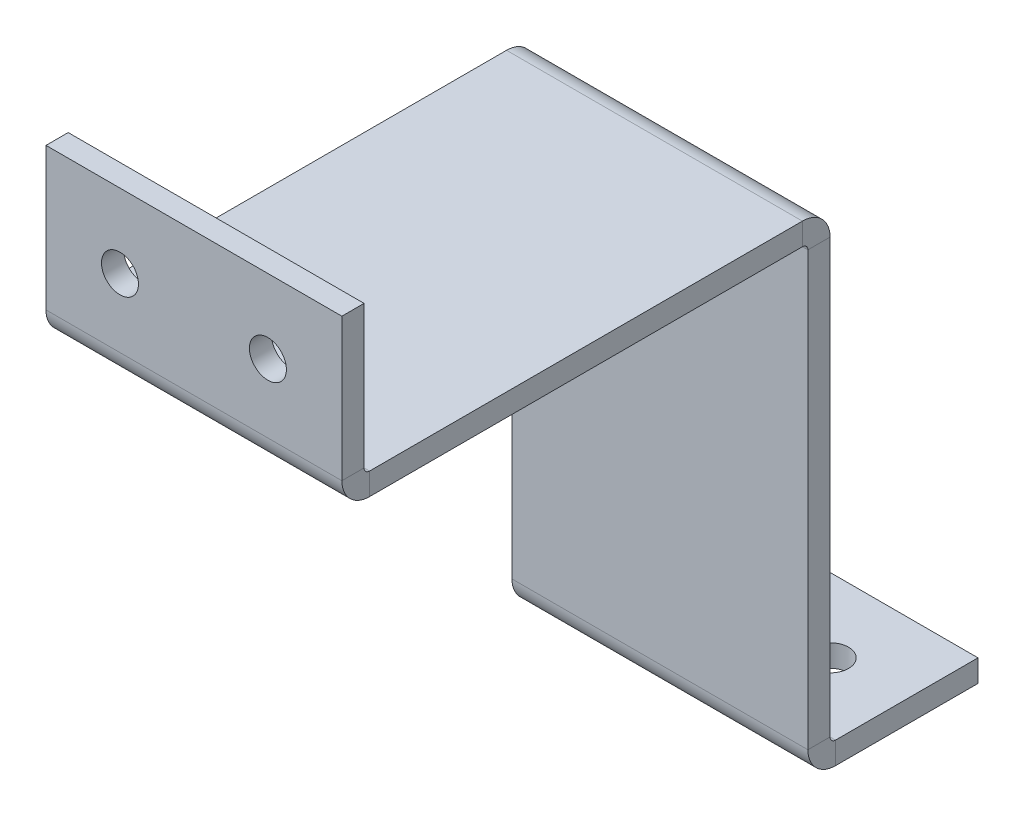
ISO-10303-21;
HEADER;
FILE_DESCRIPTION(('STEP AP214'),'2;1');
FILE_NAME('part.step','',(''),(''),'','','');
FILE_SCHEMA(('AUTOMOTIVE_DESIGN { 1 0 10303 214 1 1 1 1 }'));
ENDSEC;
DATA;
#1=APPLICATION_CONTEXT('core data for automotive mechanical design processes');
#2=APPLICATION_PROTOCOL_DEFINITION('international standard','automotive_design',2000,#1);
#3=PRODUCT_CONTEXT('',#1,'mechanical');
#4=PRODUCT('Part','Part','',(#3));
#5=PRODUCT_RELATED_PRODUCT_CATEGORY('part','',(#4));
#6=PRODUCT_DEFINITION_FORMATION('','',#4);
#7=PRODUCT_DEFINITION_CONTEXT('part definition',#1,'design');
#8=PRODUCT_DEFINITION('design','',#6,#7);
#9=PRODUCT_DEFINITION_SHAPE('','',#8);
#10=(LENGTH_UNIT() NAMED_UNIT(*) SI_UNIT(.MILLI.,.METRE.));
#11=(NAMED_UNIT(*) PLANE_ANGLE_UNIT() SI_UNIT($,.RADIAN.));
#12=(NAMED_UNIT(*) SI_UNIT($,.STERADIAN.) SOLID_ANGLE_UNIT());
#13=UNCERTAINTY_MEASURE_WITH_UNIT(LENGTH_MEASURE(1.E-05),#10,'distance_accuracy_value','');
#14=(GEOMETRIC_REPRESENTATION_CONTEXT(3) GLOBAL_UNCERTAINTY_ASSIGNED_CONTEXT((#13)) GLOBAL_UNIT_ASSIGNED_CONTEXT((#10,
#11,#12)) REPRESENTATION_CONTEXT('',''));
#15=CARTESIAN_POINT('',(0.,0.,0.));
#16=DIRECTION('',(0.,0.,1.));
#17=DIRECTION('',(1.,0.,0.));
#18=AXIS2_PLACEMENT_3D('',#15,#16,#17);
#19=CARTESIAN_POINT('',(20.,63.,73.0000000000002));
#20=DIRECTION('',(1.,0.,0.));
#21=DIRECTION('',(0.,0.,-1.));
#22=AXIS2_PLACEMENT_3D('',#19,#20,#21);
#23=PLANE('',#22);
#24=DIRECTION('',(0.,0.,1.));
#25=VECTOR('',#24,1.);
#26=CARTESIAN_POINT('',(20.,63.,73.0000000000002));
#27=LINE('',#26,#25);
#28=CARTESIAN_POINT('',(20.,63.,13.7366000000002));
#29=VERTEX_POINT('',#28);
#30=CARTESIAN_POINT('',(20.,63.,72.2634000000002));
#31=VERTEX_POINT('',#30);
#32=EDGE_CURVE('E213',#29,#31,#27,.T.);
#33=ORIENTED_EDGE('',*,*,#32,.T.);
#34=DIRECTION('',(0.,-1.,0.));
#35=VECTOR('',#34,1.);
#36=CARTESIAN_POINT('',(20.,63.,72.2634000000002));
#37=LINE('',#36,#35);
#38=CARTESIAN_POINT('',(20.,60.,72.2634000000002));
#39=VERTEX_POINT('',#38);
#40=EDGE_CURVE('E189',#31,#39,#37,.T.);
#41=ORIENTED_EDGE('',*,*,#40,.T.);
#42=DIRECTION('',(0.,0.,1.));
#43=VECTOR('',#42,1.);
#44=CARTESIAN_POINT('',(20.,60.,73.0000000000002));
#45=LINE('',#44,#43);
#46=CARTESIAN_POINT('',(20.,60.,13.7366000000002));
#47=VERTEX_POINT('',#46);
#48=EDGE_CURVE('E212',#47,#39,#45,.T.);
#49=ORIENTED_EDGE('',*,*,#48,.F.);
#50=DIRECTION('',(0.,1.,0.));
#51=VECTOR('',#50,1.);
#52=CARTESIAN_POINT('',(20.,60.,13.7366000000002));
#53=LINE('',#52,#51);
#54=EDGE_CURVE('E199',#47,#29,#53,.T.);
#55=ORIENTED_EDGE('',*,*,#54,.T.);
#56=EDGE_LOOP('',(#33,#41,#49,#55));
#57=FACE_BOUND('',#56,.T.);
#58=ADVANCED_FACE('F32',(#57),#23,.T.);
#59=CARTESIAN_POINT('',(-20.,63.,13.0000000000002));
#60=DIRECTION('',(0.,1.,0.));
#61=DIRECTION('',(0.,0.,1.));
#62=AXIS2_PLACEMENT_3D('',#59,#60,#61);
#63=PLANE('',#62);
#64=DIRECTION('',(0.,0.,-1.));
#65=VECTOR('',#64,1.);
#66=CARTESIAN_POINT('',(-20.,63.,13.0000000000002));
#67=LINE('',#66,#65);
#68=CARTESIAN_POINT('',(-20.,63.,72.2634000000002));
#69=VERTEX_POINT('',#68);
#70=CARTESIAN_POINT('',(-20.,63.,13.7366000000002));
#71=VERTEX_POINT('',#70);
#72=EDGE_CURVE('E215',#69,#71,#67,.T.);
#73=ORIENTED_EDGE('',*,*,#72,.F.);
#74=DIRECTION('',(1.,0.,0.));
#75=VECTOR('',#74,1.);
#76=CARTESIAN_POINT('',(20.,63.,72.2634000000002));
#77=LINE('',#76,#75);
#78=EDGE_CURVE('E54',#31,#69,#77,.F.);
#79=ORIENTED_EDGE('',*,*,#78,.F.);
#80=ORIENTED_EDGE('',*,*,#32,.F.);
#81=DIRECTION('',(-1.,0.,0.));
#82=VECTOR('',#81,1.);
#83=CARTESIAN_POINT('',(-20.,63.,13.7366000000002));
#84=LINE('',#83,#82);
#85=EDGE_CURVE('E207',#29,#71,#84,.T.);
#86=ORIENTED_EDGE('',*,*,#85,.T.);
#87=EDGE_LOOP('',(#73,#79,#80,#86));
#88=FACE_BOUND('',#87,.T.);
#89=ADVANCED_FACE('F385',(#88),#63,.T.);
#90=CARTESIAN_POINT('',(-20.,60.,13.0000000000002));
#91=DIRECTION('',(0.,1.,0.));
#92=DIRECTION('',(0.,0.,1.));
#93=AXIS2_PLACEMENT_3D('',#90,#91,#92);
#94=PLANE('',#93);
#95=DIRECTION('',(1.,0.,0.));
#96=VECTOR('',#95,1.);
#97=CARTESIAN_POINT('',(20.,60.,72.2634000000002));
#98=LINE('',#97,#96);
#99=CARTESIAN_POINT('',(-20.,60.,72.2634000000002));
#100=VERTEX_POINT('',#99);
#101=EDGE_CURVE('E183',#39,#100,#98,.F.);
#102=ORIENTED_EDGE('',*,*,#101,.T.);
#103=DIRECTION('',(0.,0.,-1.));
#104=VECTOR('',#103,1.);
#105=CARTESIAN_POINT('',(-20.,60.,13.0000000000002));
#106=LINE('',#105,#104);
#107=CARTESIAN_POINT('',(-20.,60.,13.7366000000002));
#108=VERTEX_POINT('',#107);
#109=EDGE_CURVE('E216',#100,#108,#106,.T.);
#110=ORIENTED_EDGE('',*,*,#109,.T.);
#111=DIRECTION('',(-1.,0.,0.));
#112=VECTOR('',#111,1.);
#113=CARTESIAN_POINT('',(20.,60.,13.7366000000002));
#114=LINE('',#113,#112);
#115=EDGE_CURVE('E201',#47,#108,#114,.T.);
#116=ORIENTED_EDGE('',*,*,#115,.F.);
#117=ORIENTED_EDGE('',*,*,#48,.T.);
#118=EDGE_LOOP('',(#102,#110,#116,#117));
#119=FACE_BOUND('',#118,.T.);
#120=ADVANCED_FACE('F342',(#119),#94,.F.);
#121=CARTESIAN_POINT('',(-20.,60.,13.0000000000002));
#122=DIRECTION('',(-1.,0.,0.));
#123=DIRECTION('',(0.,-1.,0.));
#124=AXIS2_PLACEMENT_3D('',#121,#122,#123);
#125=PLANE('',#124);
#126=DIRECTION('',(0.,1.,0.));
#127=VECTOR('',#126,1.);
#128=CARTESIAN_POINT('',(-20.,60.,13.0000000000002));
#129=LINE('',#128,#127);
#130=CARTESIAN_POINT('',(-20.,0.736599999999984,13.));
#131=VERTEX_POINT('',#130);
#132=CARTESIAN_POINT('',(-20.,59.2634,13.0000000000002));
#133=VERTEX_POINT('',#132);
#134=EDGE_CURVE('E256',#131,#133,#129,.T.);
#135=ORIENTED_EDGE('',*,*,#134,.T.);
#136=DIRECTION('',(0.,0.,-1.));
#137=VECTOR('',#136,1.);
#138=CARTESIAN_POINT('',(-20.,59.2634,13.0000000000002));
#139=LINE('',#138,#137);
#140=CARTESIAN_POINT('',(-20.,59.2634,10.0000000000002));
#141=VERTEX_POINT('',#140);
#142=EDGE_CURVE('E228',#133,#141,#139,.T.);
#143=ORIENTED_EDGE('',*,*,#142,.T.);
#144=DIRECTION('',(0.,1.,0.));
#145=VECTOR('',#144,1.);
#146=CARTESIAN_POINT('',(-20.,60.,10.0000000000002));
#147=LINE('',#146,#145);
#148=CARTESIAN_POINT('',(-20.,0.736599999999994,10.));
#149=VERTEX_POINT('',#148);
#150=EDGE_CURVE('E255',#149,#141,#147,.T.);
#151=ORIENTED_EDGE('',*,*,#150,.F.);
#152=DIRECTION('',(0.,0.,1.));
#153=VECTOR('',#152,1.);
#154=CARTESIAN_POINT('',(-20.,0.736599999999997,10.));
#155=LINE('',#154,#153);
#156=EDGE_CURVE('E242',#149,#131,#155,.T.);
#157=ORIENTED_EDGE('',*,*,#156,.T.);
#158=EDGE_LOOP('',(#135,#143,#151,#157));
#159=FACE_BOUND('',#158,.T.);
#160=ADVANCED_FACE('F329',(#159),#125,.T.);
#161=CARTESIAN_POINT('',(20.,0.,13.));
#162=DIRECTION('',(0.,0.,1.));
#163=DIRECTION('',(0.,-1.,0.));
#164=AXIS2_PLACEMENT_3D('',#161,#162,#163);
#165=PLANE('',#164);
#166=DIRECTION('',(0.,-1.,0.));
#167=VECTOR('',#166,1.);
#168=CARTESIAN_POINT('',(20.,0.,13.));
#169=LINE('',#168,#167);
#170=CARTESIAN_POINT('',(20.,59.2634,13.0000000000002));
#171=VERTEX_POINT('',#170);
#172=CARTESIAN_POINT('',(20.,0.736599999999997,13.));
#173=VERTEX_POINT('',#172);
#174=EDGE_CURVE('E259',#171,#173,#169,.T.);
#175=ORIENTED_EDGE('',*,*,#174,.F.);
#176=DIRECTION('',(-1.,0.,0.));
#177=VECTOR('',#176,1.);
#178=CARTESIAN_POINT('',(-20.,59.2634,13.0000000000002));
#179=LINE('',#178,#177);
#180=EDGE_CURVE('E234',#133,#171,#179,.F.);
#181=ORIENTED_EDGE('',*,*,#180,.F.);
#182=ORIENTED_EDGE('',*,*,#134,.F.);
#183=DIRECTION('',(1.,0.,0.));
#184=VECTOR('',#183,1.);
#185=CARTESIAN_POINT('',(20.,0.736599999999997,13.));
#186=LINE('',#185,#184);
#187=EDGE_CURVE('E250',#131,#173,#186,.T.);
#188=ORIENTED_EDGE('',*,*,#187,.T.);
#189=EDGE_LOOP('',(#175,#181,#182,#188));
#190=FACE_BOUND('',#189,.T.);
#191=ADVANCED_FACE('F326',(#190),#165,.T.);
#192=CARTESIAN_POINT('',(20.,0.,10.));
#193=DIRECTION('',(0.,0.,1.));
#194=DIRECTION('',(0.,-1.,0.));
#195=AXIS2_PLACEMENT_3D('',#192,#193,#194);
#196=PLANE('',#195);
#197=DIRECTION('',(-1.,0.,0.));
#198=VECTOR('',#197,1.);
#199=CARTESIAN_POINT('',(-20.,59.2634,10.0000000000002));
#200=LINE('',#199,#198);
#201=CARTESIAN_POINT('',(20.,59.2634,10.0000000000002));
#202=VERTEX_POINT('',#201);
#203=EDGE_CURVE('E222',#141,#202,#200,.F.);
#204=ORIENTED_EDGE('',*,*,#203,.T.);
#205=DIRECTION('',(0.,-1.,0.));
#206=VECTOR('',#205,1.);
#207=CARTESIAN_POINT('',(20.,0.,10.));
#208=LINE('',#207,#206);
#209=CARTESIAN_POINT('',(20.,0.736599999999994,10.));
#210=VERTEX_POINT('',#209);
#211=EDGE_CURVE('E260',#202,#210,#208,.T.);
#212=ORIENTED_EDGE('',*,*,#211,.T.);
#213=DIRECTION('',(1.,0.,0.));
#214=VECTOR('',#213,1.);
#215=CARTESIAN_POINT('',(-20.,0.736599999999997,10.));
#216=LINE('',#215,#214);
#217=EDGE_CURVE('E244',#149,#210,#216,.T.);
#218=ORIENTED_EDGE('',*,*,#217,.F.);
#219=ORIENTED_EDGE('',*,*,#150,.T.);
#220=EDGE_LOOP('',(#204,#212,#218,#219));
#221=FACE_BOUND('',#220,.T.);
#222=ADVANCED_FACE('F410',(#221),#196,.F.);
#223=CARTESIAN_POINT('',(20.,-3.,-10.));
#224=DIRECTION('',(1.,0.,0.));
#225=DIRECTION('',(0.,0.,-1.));
#226=AXIS2_PLACEMENT_3D('',#223,#224,#225);
#227=PLANE('',#226);
#228=DIRECTION('',(0.,0.,-1.));
#229=VECTOR('',#228,1.);
#230=CARTESIAN_POINT('',(20.,0.,-10.));
#231=LINE('',#230,#229);
#232=CARTESIAN_POINT('',(20.,0.,9.2634));
#233=VERTEX_POINT('',#232);
#234=CARTESIAN_POINT('',(20.,0.,-10.));
#235=VERTEX_POINT('',#234);
#236=EDGE_CURVE('E300',#233,#235,#231,.T.);
#237=ORIENTED_EDGE('',*,*,#236,.F.);
#238=DIRECTION('',(0.,-1.,0.));
#239=VECTOR('',#238,1.);
#240=CARTESIAN_POINT('',(20.,0.,9.2634));
#241=LINE('',#240,#239);
#242=CARTESIAN_POINT('',(20.,-3.,9.2634));
#243=VERTEX_POINT('',#242);
#244=EDGE_CURVE('E272',#233,#243,#241,.T.);
#245=ORIENTED_EDGE('',*,*,#244,.T.);
#246=DIRECTION('',(0.,0.,-1.));
#247=VECTOR('',#246,1.);
#248=CARTESIAN_POINT('',(20.,-3.,-10.));
#249=LINE('',#248,#247);
#250=CARTESIAN_POINT('',(20.,-3.,-10.));
#251=VERTEX_POINT('',#250);
#252=EDGE_CURVE('E292',#243,#251,#249,.T.);
#253=ORIENTED_EDGE('',*,*,#252,.T.);
#254=DIRECTION('',(0.,1.,0.));
#255=VECTOR('',#254,1.);
#256=CARTESIAN_POINT('',(20.,-3.,-10.));
#257=LINE('',#256,#255);
#258=EDGE_CURVE('E36',#251,#235,#257,.T.);
#259=ORIENTED_EDGE('',*,*,#258,.T.);
#260=EDGE_LOOP('',(#237,#245,#253,#259));
#261=FACE_BOUND('',#260,.T.);
#262=ADVANCED_FACE('F413',(#261),#227,.T.);
#263=CARTESIAN_POINT('',(-20.,-3.,10.));
#264=DIRECTION('',(0.,1.,0.));
#265=DIRECTION('',(0.,0.,1.));
#266=AXIS2_PLACEMENT_3D('',#263,#264,#265);
#267=PLANE('',#266);
#268=CARTESIAN_POINT('',(10.,-3.,0.));
#269=DIRECTION('',(0.,1.,0.));
#270=DIRECTION('',(0.,0.,1.));
#271=AXIS2_PLACEMENT_3D('',#268,#269,#270);
#272=CIRCLE('',#271,2.49999999999999);
#273=CARTESIAN_POINT('',(10.,-3.,2.49999999999999));
#274=VERTEX_POINT('',#273);
#275=EDGE_CURVE('E693',#274,#274,#272,.T.);
#276=ORIENTED_EDGE('',*,*,#275,.T.);
#277=EDGE_LOOP('',(#276));
#278=FACE_BOUND('',#277,.T.);
#279=CARTESIAN_POINT('',(-10.,-3.,0.));
#280=DIRECTION('',(0.,1.,0.));
#281=DIRECTION('',(0.,0.,1.));
#282=AXIS2_PLACEMENT_3D('',#279,#280,#281);
#283=CIRCLE('',#282,2.49999999999999);
#284=CARTESIAN_POINT('',(-10.,-3.,2.49999999999999));
#285=VERTEX_POINT('',#284);
#286=EDGE_CURVE('E359',#285,#285,#283,.T.);
#287=ORIENTED_EDGE('',*,*,#286,.T.);
#288=EDGE_LOOP('',(#287));
#289=FACE_BOUND('',#288,.T.);
#290=DIRECTION('',(1.,0.,0.));
#291=VECTOR('',#290,1.);
#292=CARTESIAN_POINT('',(20.,-3.,9.2634));
#293=LINE('',#292,#291);
#294=CARTESIAN_POINT('',(-20.,-3.,9.2634));
#295=VERTEX_POINT('',#294);
#296=EDGE_CURVE('E266',#243,#295,#293,.F.);
#297=ORIENTED_EDGE('',*,*,#296,.T.);
#298=DIRECTION('',(0.,0.,1.));
#299=VECTOR('',#298,1.);
#300=CARTESIAN_POINT('',(-20.,-3.,-10.));
#301=LINE('',#300,#299);
#302=CARTESIAN_POINT('',(-20.,-3.,-10.));
#303=VERTEX_POINT('',#302);
#304=EDGE_CURVE('E289',#303,#295,#301,.T.);
#305=ORIENTED_EDGE('',*,*,#304,.F.);
#306=DIRECTION('',(-1.,0.,0.));
#307=VECTOR('',#306,1.);
#308=CARTESIAN_POINT('',(-20.,-3.,-10.));
#309=LINE('',#308,#307);
#310=EDGE_CURVE('E295',#251,#303,#309,.T.);
#311=ORIENTED_EDGE('',*,*,#310,.F.);
#312=ORIENTED_EDGE('',*,*,#252,.F.);
#313=EDGE_LOOP('',(#297,#305,#311,#312));
#314=FACE_BOUND('',#313,.T.);
#315=ADVANCED_FACE('F432',(#278,#289,#314),#267,.F.);
#316=CARTESIAN_POINT('',(-20.,0.,10.));
#317=DIRECTION('',(0.,1.,0.));
#318=DIRECTION('',(0.,0.,1.));
#319=AXIS2_PLACEMENT_3D('',#316,#317,#318);
#320=PLANE('',#319);
#321=CARTESIAN_POINT('',(10.,0.,0.));
#322=DIRECTION('',(0.,1.,0.));
#323=DIRECTION('',(0.,0.,1.));
#324=AXIS2_PLACEMENT_3D('',#321,#322,#323);
#325=CIRCLE('',#324,2.49999999999999);
#326=CARTESIAN_POINT('',(10.,0.,2.49999999999999));
#327=VERTEX_POINT('',#326);
#328=EDGE_CURVE('E690',#327,#327,#325,.T.);
#329=ORIENTED_EDGE('',*,*,#328,.F.);
#330=EDGE_LOOP('',(#329));
#331=FACE_BOUND('',#330,.T.);
#332=CARTESIAN_POINT('',(-10.,0.,0.));
#333=DIRECTION('',(0.,1.,0.));
#334=DIRECTION('',(0.,0.,1.));
#335=AXIS2_PLACEMENT_3D('',#332,#333,#334);
#336=CIRCLE('',#335,2.49999999999999);
#337=CARTESIAN_POINT('',(-10.,0.,2.49999999999999));
#338=VERTEX_POINT('',#337);
#339=EDGE_CURVE('E695',#338,#338,#336,.T.);
#340=ORIENTED_EDGE('',*,*,#339,.F.);
#341=EDGE_LOOP('',(#340));
#342=FACE_BOUND('',#341,.T.);
#343=DIRECTION('',(0.,0.,1.));
#344=VECTOR('',#343,1.);
#345=CARTESIAN_POINT('',(-20.,0.,-10.));
#346=LINE('',#345,#344);
#347=CARTESIAN_POINT('',(-20.,0.,-10.));
#348=VERTEX_POINT('',#347);
#349=CARTESIAN_POINT('',(-20.,0.,9.2634));
#350=VERTEX_POINT('',#349);
#351=EDGE_CURVE('E286',#348,#350,#346,.T.);
#352=ORIENTED_EDGE('',*,*,#351,.T.);
#353=DIRECTION('',(1.,0.,0.));
#354=VECTOR('',#353,1.);
#355=CARTESIAN_POINT('',(20.,0.,9.2634));
#356=LINE('',#355,#354);
#357=EDGE_CURVE('E278',#233,#350,#356,.F.);
#358=ORIENTED_EDGE('',*,*,#357,.F.);
#359=ORIENTED_EDGE('',*,*,#236,.T.);
#360=DIRECTION('',(-1.,0.,0.));
#361=VECTOR('',#360,1.);
#362=CARTESIAN_POINT('',(-20.,0.,-10.));
#363=LINE('',#362,#361);
#364=EDGE_CURVE('E293',#235,#348,#363,.T.);
#365=ORIENTED_EDGE('',*,*,#364,.T.);
#366=EDGE_LOOP('',(#352,#358,#359,#365));
#367=FACE_BOUND('',#366,.T.);
#368=ADVANCED_FACE('F305',(#331,#342,#367),#320,.T.);
#369=CARTESIAN_POINT('',(-20.,-3.,-10.));
#370=DIRECTION('',(-1.,0.,0.));
#371=DIRECTION('',(0.,0.,1.));
#372=AXIS2_PLACEMENT_3D('',#369,#370,#371);
#373=PLANE('',#372);
#374=DIRECTION('',(0.,-1.,0.));
#375=VECTOR('',#374,1.);
#376=CARTESIAN_POINT('',(-20.,0.,9.2634));
#377=LINE('',#376,#375);
#378=EDGE_CURVE('E283',#350,#295,#377,.T.);
#379=ORIENTED_EDGE('',*,*,#378,.F.);
#380=ORIENTED_EDGE('',*,*,#351,.F.);
#381=DIRECTION('',(0.,1.,0.));
#382=VECTOR('',#381,1.);
#383=CARTESIAN_POINT('',(-20.,-3.,-10.));
#384=LINE('',#383,#382);
#385=EDGE_CURVE('E11',#303,#348,#384,.T.);
#386=ORIENTED_EDGE('',*,*,#385,.F.);
#387=ORIENTED_EDGE('',*,*,#304,.T.);
#388=EDGE_LOOP('',(#379,#380,#386,#387));
#389=FACE_BOUND('',#388,.T.);
#390=ADVANCED_FACE('F34',(#389),#373,.T.);
#391=CARTESIAN_POINT('',(-20.,-3.,-10.));
#392=DIRECTION('',(0.,0.,-1.));
#393=DIRECTION('',(-1.,0.,0.));
#394=AXIS2_PLACEMENT_3D('',#391,#392,#393);
#395=PLANE('',#394);
#396=ORIENTED_EDGE('',*,*,#364,.F.);
#397=ORIENTED_EDGE('',*,*,#258,.F.);
#398=ORIENTED_EDGE('',*,*,#310,.T.);
#399=ORIENTED_EDGE('',*,*,#385,.T.);
#400=EDGE_LOOP('',(#396,#397,#398,#399));
#401=FACE_BOUND('',#400,.T.);
#402=ADVANCED_FACE('F311',(#401),#395,.T.);
#403=CARTESIAN_POINT('',(-20.,0.736599999999997,9.2634));
#404=DIRECTION('',(-1.,0.,0.));
#405=DIRECTION('',(0.,0.,1.));
#406=AXIS2_PLACEMENT_3D('',#403,#404,#405);
#407=PLANE('',#406);
#408=ORIENTED_EDGE('',*,*,#156,.F.);
#409=CARTESIAN_POINT('',(-20.,0.736599999999997,9.2634));
#410=DIRECTION('',(1.,0.,0.));
#411=DIRECTION('',(0.,0.,-1.));
#412=AXIS2_PLACEMENT_3D('',#409,#410,#411);
#413=CIRCLE('',#412,0.7366);
#414=EDGE_CURVE('E275',#350,#149,#413,.F.);
#415=ORIENTED_EDGE('',*,*,#414,.F.);
#416=ORIENTED_EDGE('',*,*,#378,.T.);
#417=CARTESIAN_POINT('',(-20.,0.736599999999997,9.2634));
#418=DIRECTION('',(1.,0.,0.));
#419=DIRECTION('',(0.,0.,-1.));
#420=AXIS2_PLACEMENT_3D('',#417,#418,#419);
#421=CIRCLE('',#420,3.7366);
#422=EDGE_CURVE('E268',#295,#131,#421,.F.);
#423=ORIENTED_EDGE('',*,*,#422,.T.);
#424=EDGE_LOOP('',(#408,#415,#416,#423));
#425=FACE_BOUND('',#424,.T.);
#426=ADVANCED_FACE('F318',(#425),#407,.T.);
#427=CARTESIAN_POINT('',(20.,0.736599999999997,9.2634));
#428=DIRECTION('',(-1.,0.,0.));
#429=DIRECTION('',(0.,0.,1.));
#430=AXIS2_PLACEMENT_3D('',#427,#428,#429);
#431=PLANE('',#430);
#432=CARTESIAN_POINT('',(20.,0.736599999999997,9.2634));
#433=DIRECTION('',(1.,0.,0.));
#434=DIRECTION('',(0.,0.,-1.));
#435=AXIS2_PLACEMENT_3D('',#432,#433,#434);
#436=CIRCLE('',#435,0.7366);
#437=EDGE_CURVE('E262',#210,#233,#436,.T.);
#438=ORIENTED_EDGE('',*,*,#437,.F.);
#439=DIRECTION('',(0.,0.,1.));
#440=VECTOR('',#439,1.);
#441=CARTESIAN_POINT('',(20.,0.736599999999997,10.));
#442=LINE('',#441,#440);
#443=EDGE_CURVE('E247',#210,#173,#442,.T.);
#444=ORIENTED_EDGE('',*,*,#443,.T.);
#445=CARTESIAN_POINT('',(20.,0.736599999999997,9.2634));
#446=DIRECTION('',(1.,0.,0.));
#447=DIRECTION('',(0.,0.,-1.));
#448=AXIS2_PLACEMENT_3D('',#445,#446,#447);
#449=CIRCLE('',#448,3.7366);
#450=EDGE_CURVE('E269',#173,#243,#449,.T.);
#451=ORIENTED_EDGE('',*,*,#450,.T.);
#452=ORIENTED_EDGE('',*,*,#244,.F.);
#453=EDGE_LOOP('',(#438,#444,#451,#452));
#454=FACE_BOUND('',#453,.T.);
#455=ADVANCED_FACE('F423',(#454),#431,.F.);
#456=CARTESIAN_POINT('',(20.,0.736599999999997,9.2634));
#457=DIRECTION('',(1.,0.,0.));
#458=DIRECTION('',(0.,0.,1.));
#459=AXIS2_PLACEMENT_3D('',#456,#457,#458);
#460=CYLINDRICAL_SURFACE('',#459,3.7366);
#461=ORIENTED_EDGE('',*,*,#296,.F.);
#462=ORIENTED_EDGE('',*,*,#450,.F.);
#463=ORIENTED_EDGE('',*,*,#187,.F.);
#464=ORIENTED_EDGE('',*,*,#422,.F.);
#465=EDGE_LOOP('',(#461,#462,#463,#464));
#466=FACE_BOUND('',#465,.T.);
#467=ADVANCED_FACE('F321',(#466),#460,.T.);
#468=CARTESIAN_POINT('',(20.,0.736599999999997,9.2634));
#469=DIRECTION('',(1.,0.,0.));
#470=DIRECTION('',(0.,0.,1.));
#471=AXIS2_PLACEMENT_3D('',#468,#469,#470);
#472=CYLINDRICAL_SURFACE('',#471,0.7366);
#473=ORIENTED_EDGE('',*,*,#357,.T.);
#474=ORIENTED_EDGE('',*,*,#414,.T.);
#475=ORIENTED_EDGE('',*,*,#217,.T.);
#476=ORIENTED_EDGE('',*,*,#437,.T.);
#477=EDGE_LOOP('',(#473,#474,#475,#476));
#478=FACE_BOUND('',#477,.T.);
#479=ADVANCED_FACE('F417',(#478),#472,.F.);
#480=CARTESIAN_POINT('',(20.,0.,13.));
#481=DIRECTION('',(1.,0.,0.));
#482=DIRECTION('',(0.,0.,-1.));
#483=AXIS2_PLACEMENT_3D('',#480,#481,#482);
#484=PLANE('',#483);
#485=DIRECTION('',(0.,0.,-1.));
#486=VECTOR('',#485,1.);
#487=CARTESIAN_POINT('',(20.,59.2634,13.0000000000002));
#488=LINE('',#487,#486);
#489=EDGE_CURVE('E239',#171,#202,#488,.T.);
#490=ORIENTED_EDGE('',*,*,#489,.F.);
#491=ORIENTED_EDGE('',*,*,#174,.T.);
#492=ORIENTED_EDGE('',*,*,#443,.F.);
#493=ORIENTED_EDGE('',*,*,#211,.F.);
#494=EDGE_LOOP('',(#490,#491,#492,#493));
#495=FACE_BOUND('',#494,.T.);
#496=ADVANCED_FACE('F404',(#495),#484,.T.);
#497=CARTESIAN_POINT('',(20.,59.2634,13.7366000000002));
#498=DIRECTION('',(1.,0.,0.));
#499=DIRECTION('',(0.,0.,-1.));
#500=AXIS2_PLACEMENT_3D('',#497,#498,#499);
#501=PLANE('',#500);
#502=ORIENTED_EDGE('',*,*,#54,.F.);
#503=CARTESIAN_POINT('',(20.,59.2634,13.7366000000002));
#504=DIRECTION('',(-1.,0.,0.));
#505=DIRECTION('',(0.,0.,1.));
#506=AXIS2_PLACEMENT_3D('',#503,#504,#505);
#507=CIRCLE('',#506,0.736599999999997);
#508=EDGE_CURVE('E231',#171,#47,#507,.F.);
#509=ORIENTED_EDGE('',*,*,#508,.F.);
#510=ORIENTED_EDGE('',*,*,#489,.T.);
#511=CARTESIAN_POINT('',(20.,59.2634,13.7366000000002));
#512=DIRECTION('',(-1.,0.,0.));
#513=DIRECTION('',(0.,0.,1.));
#514=AXIS2_PLACEMENT_3D('',#511,#512,#513);
#515=CIRCLE('',#514,3.7366);
#516=EDGE_CURVE('E224',#202,#29,#515,.F.);
#517=ORIENTED_EDGE('',*,*,#516,.T.);
#518=EDGE_LOOP('',(#502,#509,#510,#517));
#519=FACE_BOUND('',#518,.T.);
#520=ADVANCED_FACE('F399',(#519),#501,.T.);
#521=CARTESIAN_POINT('',(-20.,59.2634,13.7366000000002));
#522=DIRECTION('',(1.,0.,0.));
#523=DIRECTION('',(0.,0.,-1.));
#524=AXIS2_PLACEMENT_3D('',#521,#522,#523);
#525=PLANE('',#524);
#526=CARTESIAN_POINT('',(-20.,59.2634,13.7366000000002));
#527=DIRECTION('',(-1.,0.,0.));
#528=DIRECTION('',(0.,0.,1.));
#529=AXIS2_PLACEMENT_3D('',#526,#527,#528);
#530=CIRCLE('',#529,0.736599999999997);
#531=EDGE_CURVE('E218',#108,#133,#530,.T.);
#532=ORIENTED_EDGE('',*,*,#531,.F.);
#533=DIRECTION('',(0.,1.,0.));
#534=VECTOR('',#533,1.);
#535=CARTESIAN_POINT('',(-20.,60.,13.7366000000002));
#536=LINE('',#535,#534);
#537=EDGE_CURVE('E204',#108,#71,#536,.T.);
#538=ORIENTED_EDGE('',*,*,#537,.T.);
#539=CARTESIAN_POINT('',(-20.,59.2634,13.7366000000002));
#540=DIRECTION('',(-1.,0.,0.));
#541=DIRECTION('',(0.,0.,1.));
#542=AXIS2_PLACEMENT_3D('',#539,#540,#541);
#543=CIRCLE('',#542,3.7366);
#544=EDGE_CURVE('E225',#71,#141,#543,.T.);
#545=ORIENTED_EDGE('',*,*,#544,.T.);
#546=ORIENTED_EDGE('',*,*,#142,.F.);
#547=EDGE_LOOP('',(#532,#538,#545,#546));
#548=FACE_BOUND('',#547,.T.);
#549=ADVANCED_FACE('F333',(#548),#525,.F.);
#550=CARTESIAN_POINT('',(-20.,59.2634,13.7366000000002));
#551=DIRECTION('',(-1.,0.,0.));
#552=DIRECTION('',(0.,1.,0.));
#553=AXIS2_PLACEMENT_3D('',#550,#551,#552);
#554=CYLINDRICAL_SURFACE('',#553,3.7366);
#555=ORIENTED_EDGE('',*,*,#203,.F.);
#556=ORIENTED_EDGE('',*,*,#544,.F.);
#557=ORIENTED_EDGE('',*,*,#85,.F.);
#558=ORIENTED_EDGE('',*,*,#516,.F.);
#559=EDGE_LOOP('',(#555,#556,#557,#558));
#560=FACE_BOUND('',#559,.T.);
#561=ADVANCED_FACE('F395',(#560),#554,.T.);
#562=CARTESIAN_POINT('',(-20.,59.2634,13.7366000000002));
#563=DIRECTION('',(-1.,0.,0.));
#564=DIRECTION('',(0.,1.,0.));
#565=AXIS2_PLACEMENT_3D('',#562,#563,#564);
#566=CYLINDRICAL_SURFACE('',#565,0.736599999999997);
#567=ORIENTED_EDGE('',*,*,#180,.T.);
#568=ORIENTED_EDGE('',*,*,#508,.T.);
#569=ORIENTED_EDGE('',*,*,#115,.T.);
#570=ORIENTED_EDGE('',*,*,#531,.T.);
#571=EDGE_LOOP('',(#567,#568,#569,#570));
#572=FACE_BOUND('',#571,.T.);
#573=ADVANCED_FACE('F337',(#572),#566,.F.);
#574=CARTESIAN_POINT('',(-20.,63.,13.0000000000002));
#575=DIRECTION('',(-1.,0.,0.));
#576=DIRECTION('',(0.,0.,1.));
#577=AXIS2_PLACEMENT_3D('',#574,#575,#576);
#578=PLANE('',#577);
#579=DIRECTION('',(0.,-1.,0.));
#580=VECTOR('',#579,1.);
#581=CARTESIAN_POINT('',(-20.,63.,72.2634000000002));
#582=LINE('',#581,#580);
#583=EDGE_CURVE('E47',#69,#100,#582,.T.);
#584=ORIENTED_EDGE('',*,*,#583,.F.);
#585=ORIENTED_EDGE('',*,*,#72,.T.);
#586=ORIENTED_EDGE('',*,*,#537,.F.);
#587=ORIENTED_EDGE('',*,*,#109,.F.);
#588=EDGE_LOOP('',(#584,#585,#586,#587));
#589=FACE_BOUND('',#588,.T.);
#590=ADVANCED_FACE('F393',(#589),#578,.T.);
#591=CARTESIAN_POINT('',(-20.,63.7366,72.2634000000002));
#592=DIRECTION('',(-1.,0.,0.));
#593=DIRECTION('',(0.,0.,1.));
#594=AXIS2_PLACEMENT_3D('',#591,#592,#593);
#595=PLANE('',#594);
#596=DIRECTION('',(0.,0.,1.));
#597=VECTOR('',#596,1.);
#598=CARTESIAN_POINT('',(-20.,63.7366,73.0000000000002));
#599=LINE('',#598,#597);
#600=CARTESIAN_POINT('',(-20.,63.7366,73.0000000000002));
#601=VERTEX_POINT('',#600);
#602=CARTESIAN_POINT('',(-20.,63.7366,76.0000000000002));
#603=VERTEX_POINT('',#602);
#604=EDGE_CURVE('E153',#601,#603,#599,.T.);
#605=ORIENTED_EDGE('',*,*,#604,.F.);
#606=CARTESIAN_POINT('',(-20.,63.7366,72.2634000000002));
#607=DIRECTION('',(1.,0.,0.));
#608=DIRECTION('',(0.,0.,-1.));
#609=AXIS2_PLACEMENT_3D('',#606,#607,#608);
#610=CIRCLE('',#609,0.736600000000004);
#611=EDGE_CURVE('E192',#69,#601,#610,.F.);
#612=ORIENTED_EDGE('',*,*,#611,.F.);
#613=ORIENTED_EDGE('',*,*,#583,.T.);
#614=CARTESIAN_POINT('',(-20.,63.7366,72.2634000000002));
#615=DIRECTION('',(1.,0.,0.));
#616=DIRECTION('',(0.,0.,-1.));
#617=AXIS2_PLACEMENT_3D('',#614,#615,#616);
#618=CIRCLE('',#617,3.7366);
#619=EDGE_CURVE('E185',#100,#603,#618,.F.);
#620=ORIENTED_EDGE('',*,*,#619,.T.);
#621=EDGE_LOOP('',(#605,#612,#613,#620));
#622=FACE_BOUND('',#621,.T.);
#623=ADVANCED_FACE('F452',(#622),#595,.T.);
#624=CARTESIAN_POINT('',(20.,63.7366,72.2634000000002));
#625=DIRECTION('',(-1.,0.,0.));
#626=DIRECTION('',(0.,0.,1.));
#627=AXIS2_PLACEMENT_3D('',#624,#625,#626);
#628=PLANE('',#627);
#629=CARTESIAN_POINT('',(20.,63.7366,72.2634000000002));
#630=DIRECTION('',(1.,0.,0.));
#631=DIRECTION('',(0.,0.,-1.));
#632=AXIS2_PLACEMENT_3D('',#629,#630,#631);
#633=CIRCLE('',#632,0.736600000000004);
#634=CARTESIAN_POINT('',(20.,63.7366,73.0000000000002));
#635=VERTEX_POINT('',#634);
#636=EDGE_CURVE('E181',#635,#31,#633,.T.);
#637=ORIENTED_EDGE('',*,*,#636,.F.);
#638=DIRECTION('',(0.,0.,1.));
#639=VECTOR('',#638,1.);
#640=CARTESIAN_POINT('',(20.,63.7366,73.0000000000002));
#641=LINE('',#640,#639);
#642=CARTESIAN_POINT('',(20.,63.7366,76.0000000000002));
#643=VERTEX_POINT('',#642);
#644=EDGE_CURVE('E356',#635,#643,#641,.T.);
#645=ORIENTED_EDGE('',*,*,#644,.T.);
#646=CARTESIAN_POINT('',(20.,63.7366,72.2634000000002));
#647=DIRECTION('',(1.,0.,0.));
#648=DIRECTION('',(0.,0.,-1.));
#649=AXIS2_PLACEMENT_3D('',#646,#647,#648);
#650=CIRCLE('',#649,3.7366);
#651=EDGE_CURVE('E186',#643,#39,#650,.T.);
#652=ORIENTED_EDGE('',*,*,#651,.T.);
#653=ORIENTED_EDGE('',*,*,#40,.F.);
#654=EDGE_LOOP('',(#637,#645,#652,#653));
#655=FACE_BOUND('',#654,.T.);
#656=ADVANCED_FACE('F348',(#655),#628,.F.);
#657=CARTESIAN_POINT('',(20.,63.7366,72.2634000000002));
#658=DIRECTION('',(1.,0.,0.));
#659=DIRECTION('',(0.,0.,1.));
#660=AXIS2_PLACEMENT_3D('',#657,#658,#659);
#661=CYLINDRICAL_SURFACE('',#660,3.7366);
#662=ORIENTED_EDGE('',*,*,#101,.F.);
#663=ORIENTED_EDGE('',*,*,#651,.F.);
#664=DIRECTION('',(1.,0.,0.));
#665=VECTOR('',#664,1.);
#666=CARTESIAN_POINT('',(20.,63.7366,76.0000000000002));
#667=LINE('',#666,#665);
#668=EDGE_CURVE('E177',#603,#643,#667,.T.);
#669=ORIENTED_EDGE('',*,*,#668,.F.);
#670=ORIENTED_EDGE('',*,*,#619,.F.);
#671=EDGE_LOOP('',(#662,#663,#669,#670));
#672=FACE_BOUND('',#671,.T.);
#673=ADVANCED_FACE('F453',(#672),#661,.T.);
#674=CARTESIAN_POINT('',(20.,63.7366,72.2634000000002));
#675=DIRECTION('',(1.,0.,0.));
#676=DIRECTION('',(0.,0.,1.));
#677=AXIS2_PLACEMENT_3D('',#674,#675,#676);
#678=CYLINDRICAL_SURFACE('',#677,0.736600000000004);
#679=ORIENTED_EDGE('',*,*,#78,.T.);
#680=ORIENTED_EDGE('',*,*,#611,.T.);
#681=DIRECTION('',(1.,0.,0.));
#682=VECTOR('',#681,1.);
#683=CARTESIAN_POINT('',(-20.,63.7366,73.0000000000002));
#684=LINE('',#683,#682);
#685=EDGE_CURVE('E354',#601,#635,#684,.T.);
#686=ORIENTED_EDGE('',*,*,#685,.T.);
#687=ORIENTED_EDGE('',*,*,#636,.T.);
#688=EDGE_LOOP('',(#679,#680,#686,#687));
#689=FACE_BOUND('',#688,.T.);
#690=ADVANCED_FACE('F351',(#689),#678,.F.);
#691=CARTESIAN_POINT('',(20.,63.,76.0000000000002));
#692=DIRECTION('',(1.,0.,0.));
#693=DIRECTION('',(0.,0.,-1.));
#694=AXIS2_PLACEMENT_3D('',#691,#692,#693);
#695=PLANE('',#694);
#696=DIRECTION('',(0.,-1.,0.));
#697=VECTOR('',#696,1.);
#698=CARTESIAN_POINT('',(20.,63.,76.0000000000002));
#699=LINE('',#698,#697);
#700=CARTESIAN_POINT('',(20.,83.,76.0000000000003));
#701=VERTEX_POINT('',#700);
#702=EDGE_CURVE('E167',#701,#643,#699,.T.);
#703=ORIENTED_EDGE('',*,*,#702,.T.);
#704=ORIENTED_EDGE('',*,*,#644,.F.);
#705=DIRECTION('',(0.,-1.,0.));
#706=VECTOR('',#705,1.);
#707=CARTESIAN_POINT('',(20.,63.,73.0000000000002));
#708=LINE('',#707,#706);
#709=CARTESIAN_POINT('',(20.,83.,73.0000000000003));
#710=VERTEX_POINT('',#709);
#711=EDGE_CURVE('E158',#710,#635,#708,.T.);
#712=ORIENTED_EDGE('',*,*,#711,.F.);
#713=DIRECTION('',(0.,0.,-1.));
#714=VECTOR('',#713,1.);
#715=CARTESIAN_POINT('',(20.,83.,76.0000000000003));
#716=LINE('',#715,#714);
#717=EDGE_CURVE('E166',#701,#710,#716,.T.);
#718=ORIENTED_EDGE('',*,*,#717,.F.);
#719=EDGE_LOOP('',(#703,#704,#712,#718));
#720=FACE_BOUND('',#719,.T.);
#721=ADVANCED_FACE('F367',(#720),#695,.T.);
#722=CARTESIAN_POINT('',(-20.,83.,76.0000000000003));
#723=DIRECTION('',(-1.,0.,0.));
#724=DIRECTION('',(0.,-1.,0.));
#725=AXIS2_PLACEMENT_3D('',#722,#723,#724);
#726=PLANE('',#725);
#727=DIRECTION('',(0.,1.,0.));
#728=VECTOR('',#727,1.);
#729=CARTESIAN_POINT('',(-20.,83.,73.0000000000003));
#730=LINE('',#729,#728);
#731=CARTESIAN_POINT('',(-20.,83.,73.0000000000003));
#732=VERTEX_POINT('',#731);
#733=EDGE_CURVE('E175',#601,#732,#730,.T.);
#734=ORIENTED_EDGE('',*,*,#733,.F.);
#735=ORIENTED_EDGE('',*,*,#604,.T.);
#736=DIRECTION('',(0.,1.,0.));
#737=VECTOR('',#736,1.);
#738=CARTESIAN_POINT('',(-20.,83.,76.0000000000003));
#739=LINE('',#738,#737);
#740=CARTESIAN_POINT('',(-20.,83.,76.0000000000003));
#741=VERTEX_POINT('',#740);
#742=EDGE_CURVE('E147',#603,#741,#739,.T.);
#743=ORIENTED_EDGE('',*,*,#742,.T.);
#744=DIRECTION('',(0.,0.,-1.));
#745=VECTOR('',#744,1.);
#746=CARTESIAN_POINT('',(-20.,83.,76.0000000000003));
#747=LINE('',#746,#745);
#748=EDGE_CURVE('E151',#741,#732,#747,.T.);
#749=ORIENTED_EDGE('',*,*,#748,.T.);
#750=EDGE_LOOP('',(#734,#735,#743,#749));
#751=FACE_BOUND('',#750,.T.);
#752=ADVANCED_FACE('F150',(#751),#726,.T.);
#753=CARTESIAN_POINT('',(20.,63.,76.0000000000002));
#754=DIRECTION('',(0.,0.,1.));
#755=DIRECTION('',(0.,-1.,0.));
#756=AXIS2_PLACEMENT_3D('',#753,#754,#755);
#757=PLANE('',#756);
#758=CARTESIAN_POINT('',(-9.99999999999999,73.0000000000001,76.0000000000002));
#759=DIRECTION('',(0.,0.,1.));
#760=DIRECTION('',(0.,-1.,0.));
#761=AXIS2_PLACEMENT_3D('',#758,#759,#760);
#762=CIRCLE('',#761,2.49999999999999);
#763=CARTESIAN_POINT('',(-9.99999999999999,70.5000000000001,76.0000000000002));
#764=VERTEX_POINT('',#763);
#765=EDGE_CURVE('E678',#764,#764,#762,.T.);
#766=ORIENTED_EDGE('',*,*,#765,.F.);
#767=EDGE_LOOP('',(#766));
#768=FACE_BOUND('',#767,.T.);
#769=CARTESIAN_POINT('',(9.99999999999999,73.0000000000001,76.0000000000002));
#770=DIRECTION('',(0.,0.,1.));
#771=DIRECTION('',(0.,-1.,0.));
#772=AXIS2_PLACEMENT_3D('',#769,#770,#771);
#773=CIRCLE('',#772,2.49999999999999);
#774=CARTESIAN_POINT('',(9.99999999999999,70.5000000000001,76.0000000000002));
#775=VERTEX_POINT('',#774);
#776=EDGE_CURVE('E687',#775,#775,#773,.T.);
#777=ORIENTED_EDGE('',*,*,#776,.F.);
#778=EDGE_LOOP('',(#777));
#779=FACE_BOUND('',#778,.T.);
#780=ORIENTED_EDGE('',*,*,#742,.F.);
#781=ORIENTED_EDGE('',*,*,#668,.T.);
#782=ORIENTED_EDGE('',*,*,#702,.F.);
#783=DIRECTION('',(1.,0.,0.));
#784=VECTOR('',#783,1.);
#785=CARTESIAN_POINT('',(20.,83.,76.0000000000003));
#786=LINE('',#785,#784);
#787=EDGE_CURVE('E157',#741,#701,#786,.T.);
#788=ORIENTED_EDGE('',*,*,#787,.F.);
#789=EDGE_LOOP('',(#780,#781,#782,#788));
#790=FACE_BOUND('',#789,.T.);
#791=ADVANCED_FACE('F169',(#768,#779,#790),#757,.T.);
#792=CARTESIAN_POINT('',(20.,63.,73.0000000000002));
#793=DIRECTION('',(0.,0.,1.));
#794=DIRECTION('',(0.,-1.,0.));
#795=AXIS2_PLACEMENT_3D('',#792,#793,#794);
#796=PLANE('',#795);
#797=CARTESIAN_POINT('',(-9.99999999999999,73.0000000000001,73.0000000000002));
#798=DIRECTION('',(0.,0.,-1.));
#799=DIRECTION('',(0.,1.,0.));
#800=AXIS2_PLACEMENT_3D('',#797,#798,#799);
#801=CIRCLE('',#800,2.49999999999999);
#802=CARTESIAN_POINT('',(-9.99999999999999,75.5000000000001,73.0000000000002));
#803=VERTEX_POINT('',#802);
#804=EDGE_CURVE('E680',#803,#803,#801,.T.);
#805=ORIENTED_EDGE('',*,*,#804,.F.);
#806=EDGE_LOOP('',(#805));
#807=FACE_BOUND('',#806,.T.);
#808=CARTESIAN_POINT('',(9.99999999999999,73.0000000000001,73.0000000000002));
#809=DIRECTION('',(0.,0.,-1.));
#810=DIRECTION('',(0.,1.,0.));
#811=AXIS2_PLACEMENT_3D('',#808,#809,#810);
#812=CIRCLE('',#811,2.49999999999999);
#813=CARTESIAN_POINT('',(9.99999999999999,75.5000000000001,73.0000000000002));
#814=VERTEX_POINT('',#813);
#815=EDGE_CURVE('E682',#814,#814,#812,.T.);
#816=ORIENTED_EDGE('',*,*,#815,.F.);
#817=EDGE_LOOP('',(#816));
#818=FACE_BOUND('',#817,.T.);
#819=ORIENTED_EDGE('',*,*,#685,.F.);
#820=ORIENTED_EDGE('',*,*,#733,.T.);
#821=DIRECTION('',(1.,0.,0.));
#822=VECTOR('',#821,1.);
#823=CARTESIAN_POINT('',(20.,83.,73.0000000000003));
#824=LINE('',#823,#822);
#825=EDGE_CURVE('E165',#732,#710,#824,.T.);
#826=ORIENTED_EDGE('',*,*,#825,.T.);
#827=ORIENTED_EDGE('',*,*,#711,.T.);
#828=EDGE_LOOP('',(#819,#820,#826,#827));
#829=FACE_BOUND('',#828,.T.);
#830=ADVANCED_FACE('F369',(#807,#818,#829),#796,.F.);
#831=CARTESIAN_POINT('',(20.,83.,76.0000000000003));
#832=DIRECTION('',(0.,1.,0.));
#833=DIRECTION('',(0.,0.,1.));
#834=AXIS2_PLACEMENT_3D('',#831,#832,#833);
#835=PLANE('',#834);
#836=ORIENTED_EDGE('',*,*,#825,.F.);
#837=ORIENTED_EDGE('',*,*,#748,.F.);
#838=ORIENTED_EDGE('',*,*,#787,.T.);
#839=ORIENTED_EDGE('',*,*,#717,.T.);
#840=EDGE_LOOP('',(#836,#837,#838,#839));
#841=FACE_BOUND('',#840,.T.);
#842=ADVANCED_FACE('F162',(#841),#835,.T.);
#843=CARTESIAN_POINT('',(-10.,0.,0.));
#844=DIRECTION('',(0.,1.,0.));
#845=DIRECTION('',(0.,0.,1.));
#846=AXIS2_PLACEMENT_3D('',#843,#844,#845);
#847=CYLINDRICAL_SURFACE('',#846,2.49999999999999);
#848=ORIENTED_EDGE('',*,*,#339,.T.);
#849=EDGE_LOOP('',(#848));
#850=FACE_BOUND('',#849,.T.);
#851=ORIENTED_EDGE('',*,*,#286,.F.);
#852=EDGE_LOOP('',(#851));
#853=FACE_BOUND('',#852,.T.);
#854=ADVANCED_FACE('F377',(#850,#853),#847,.F.);
#855=CARTESIAN_POINT('',(10.,0.,0.));
#856=DIRECTION('',(0.,1.,0.));
#857=DIRECTION('',(0.,0.,1.));
#858=AXIS2_PLACEMENT_3D('',#855,#856,#857);
#859=CYLINDRICAL_SURFACE('',#858,2.49999999999999);
#860=ORIENTED_EDGE('',*,*,#328,.T.);
#861=EDGE_LOOP('',(#860));
#862=FACE_BOUND('',#861,.T.);
#863=ORIENTED_EDGE('',*,*,#275,.F.);
#864=EDGE_LOOP('',(#863));
#865=FACE_BOUND('',#864,.T.);
#866=ADVANCED_FACE('F631',(#862,#865),#859,.F.);
#867=CARTESIAN_POINT('',(9.99999999999999,73.0000000000001,73.0000000000002));
#868=DIRECTION('',(0.,0.,-1.));
#869=DIRECTION('',(0.,1.,0.));
#870=AXIS2_PLACEMENT_3D('',#867,#868,#869);
#871=CYLINDRICAL_SURFACE('',#870,2.49999999999999);
#872=ORIENTED_EDGE('',*,*,#776,.T.);
#873=EDGE_LOOP('',(#872));
#874=FACE_BOUND('',#873,.T.);
#875=ORIENTED_EDGE('',*,*,#815,.T.);
#876=EDGE_LOOP('',(#875));
#877=FACE_BOUND('',#876,.T.);
#878=ADVANCED_FACE('F641',(#874,#877),#871,.F.);
#879=CARTESIAN_POINT('',(-9.99999999999999,73.0000000000001,73.0000000000002));
#880=DIRECTION('',(0.,0.,-1.));
#881=DIRECTION('',(0.,1.,0.));
#882=AXIS2_PLACEMENT_3D('',#879,#880,#881);
#883=CYLINDRICAL_SURFACE('',#882,2.49999999999999);
#884=ORIENTED_EDGE('',*,*,#765,.T.);
#885=EDGE_LOOP('',(#884));
#886=FACE_BOUND('',#885,.T.);
#887=ORIENTED_EDGE('',*,*,#804,.T.);
#888=EDGE_LOOP('',(#887));
#889=FACE_BOUND('',#888,.T.);
#890=ADVANCED_FACE('F661',(#886,#889),#883,.F.);
#891=CLOSED_SHELL('',(#58,#89,#120,#160,#191,#222,#262,#315,#368,#390,#402,#426,#455,#467,#479,
#496,#520,#549,#561,#573,#590,#623,#656,#673,#690,#721,#752,#791,#830,#842,#854,#866,#878,#890));
#892=MANIFOLD_SOLID_BREP('B2',#891);
#893=ADVANCED_BREP_SHAPE_REPRESENTATION('',(#18,#892),#14);
#894=SHAPE_DEFINITION_REPRESENTATION(#9,#893);
ENDSEC;
END-ISO-10303-21;
